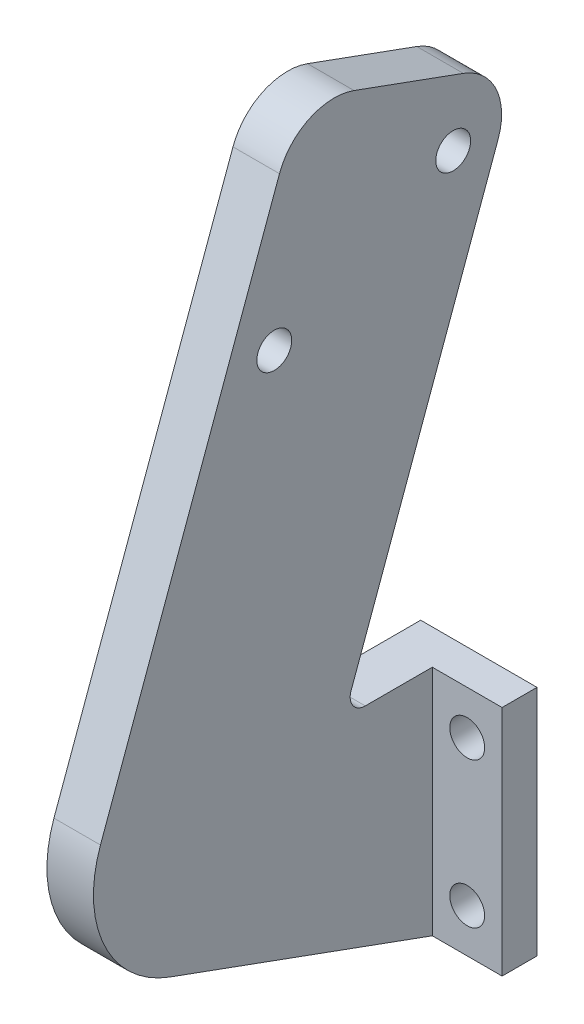
ISO-10303-21;
HEADER;
FILE_DESCRIPTION(('STEP AP214'),'2;1');
FILE_NAME('part.step','',(''),(''),'','','');
FILE_SCHEMA(('AUTOMOTIVE_DESIGN { 1 0 10303 214 1 1 1 1 }'));
ENDSEC;
DATA;
#1=APPLICATION_CONTEXT('core data for automotive mechanical design processes');
#2=APPLICATION_PROTOCOL_DEFINITION('international standard','automotive_design',2000,#1);
#3=PRODUCT_CONTEXT('',#1,'mechanical');
#4=PRODUCT('Part','Part','',(#3));
#5=PRODUCT_RELATED_PRODUCT_CATEGORY('part','',(#4));
#6=PRODUCT_DEFINITION_FORMATION('','',#4);
#7=PRODUCT_DEFINITION_CONTEXT('part definition',#1,'design');
#8=PRODUCT_DEFINITION('design','',#6,#7);
#9=PRODUCT_DEFINITION_SHAPE('','',#8);
#10=(LENGTH_UNIT() NAMED_UNIT(*) SI_UNIT(.MILLI.,.METRE.));
#11=(NAMED_UNIT(*) PLANE_ANGLE_UNIT() SI_UNIT($,.RADIAN.));
#12=(NAMED_UNIT(*) SI_UNIT($,.STERADIAN.) SOLID_ANGLE_UNIT());
#13=UNCERTAINTY_MEASURE_WITH_UNIT(LENGTH_MEASURE(1.E-05),#10,'distance_accuracy_value','');
#14=(GEOMETRIC_REPRESENTATION_CONTEXT(3) GLOBAL_UNCERTAINTY_ASSIGNED_CONTEXT((#13)) GLOBAL_UNIT_ASSIGNED_CONTEXT((#10,
#11,#12)) REPRESENTATION_CONTEXT('',''));
#15=CARTESIAN_POINT('',(0.,0.,0.));
#16=DIRECTION('',(0.,0.,1.));
#17=DIRECTION('',(1.,0.,0.));
#18=AXIS2_PLACEMENT_3D('',#15,#16,#17);
#19=CARTESIAN_POINT('',(0.,0.,0.));
#20=DIRECTION('',(0.,0.,-1.));
#21=DIRECTION('',(-1.,0.,0.));
#22=AXIS2_PLACEMENT_3D('',#19,#20,#21);
#23=PLANE('',#22);
#24=CARTESIAN_POINT('',(14.0000000000001,3.75,0.));
#25=DIRECTION('',(0.,0.,1.));
#26=DIRECTION('',(1.,0.,0.));
#27=AXIS2_PLACEMENT_3D('',#24,#25,#26);
#28=CIRCLE('',#27,1.5);
#29=CARTESIAN_POINT('',(15.5000000000001,3.75,0.));
#30=VERTEX_POINT('',#29);
#31=EDGE_CURVE('E158',#30,#30,#28,.T.);
#32=ORIENTED_EDGE('',*,*,#31,.T.);
#33=EDGE_LOOP('',(#32));
#34=FACE_BOUND('',#33,.T.);
#35=CARTESIAN_POINT('',(14.,16.25,0.));
#36=DIRECTION('',(0.,0.,1.));
#37=DIRECTION('',(1.,0.,0.));
#38=AXIS2_PLACEMENT_3D('',#35,#36,#37);
#39=CIRCLE('',#38,1.5);
#40=CARTESIAN_POINT('',(15.5,16.25,0.));
#41=VERTEX_POINT('',#40);
#42=EDGE_CURVE('E172',#41,#41,#39,.T.);
#43=ORIENTED_EDGE('',*,*,#42,.T.);
#44=EDGE_LOOP('',(#43));
#45=FACE_BOUND('',#44,.T.);
#46=DIRECTION('',(1.,0.,0.));
#47=VECTOR('',#46,1.);
#48=CARTESIAN_POINT('',(0.,0.,0.));
#49=LINE('',#48,#47);
#50=CARTESIAN_POINT('',(7.,0.,0.));
#51=VERTEX_POINT('',#50);
#52=CARTESIAN_POINT('',(17.,0.,0.));
#53=VERTEX_POINT('',#52);
#54=EDGE_CURVE('E178',#51,#53,#49,.T.);
#55=ORIENTED_EDGE('',*,*,#54,.F.);
#56=DIRECTION('',(0.,-1.,0.));
#57=VECTOR('',#56,1.);
#58=CARTESIAN_POINT('',(7.,20.,0.));
#59=LINE('',#58,#57);
#60=CARTESIAN_POINT('',(7.,20.,0.));
#61=VERTEX_POINT('',#60);
#62=EDGE_CURVE('E134',#61,#51,#59,.T.);
#63=ORIENTED_EDGE('',*,*,#62,.F.);
#64=DIRECTION('',(-1.,0.,0.));
#65=VECTOR('',#64,1.);
#66=CARTESIAN_POINT('',(0.,20.,0.));
#67=LINE('',#66,#65);
#68=CARTESIAN_POINT('',(17.,20.,0.));
#69=VERTEX_POINT('',#68);
#70=EDGE_CURVE('E185',#69,#61,#67,.T.);
#71=ORIENTED_EDGE('',*,*,#70,.F.);
#72=DIRECTION('',(0.,1.,0.));
#73=VECTOR('',#72,1.);
#74=CARTESIAN_POINT('',(17.,0.,0.));
#75=LINE('',#74,#73);
#76=EDGE_CURVE('E195',#53,#69,#75,.T.);
#77=ORIENTED_EDGE('',*,*,#76,.F.);
#78=EDGE_LOOP('',(#55,#63,#71,#77));
#79=FACE_BOUND('',#78,.T.);
#80=ADVANCED_FACE('F41',(#34,#45,#79),#23,.T.);
#81=CARTESIAN_POINT('',(0.,0.,3.));
#82=DIRECTION('',(0.,1.,0.));
#83=DIRECTION('',(0.,0.,1.));
#84=AXIS2_PLACEMENT_3D('',#81,#82,#83);
#85=PLANE('',#84);
#86=DIRECTION('',(0.,0.,1.));
#87=VECTOR('',#86,1.);
#88=CARTESIAN_POINT('',(7.,0.,0.));
#89=LINE('',#88,#87);
#90=CARTESIAN_POINT('',(7.,0.,3.));
#91=VERTEX_POINT('',#90);
#92=EDGE_CURVE('E131',#51,#91,#89,.T.);
#93=ORIENTED_EDGE('',*,*,#92,.F.);
#94=ORIENTED_EDGE('',*,*,#54,.T.);
#95=DIRECTION('',(0.,0.,-1.));
#96=VECTOR('',#95,1.);
#97=CARTESIAN_POINT('',(17.,0.,3.));
#98=LINE('',#97,#96);
#99=CARTESIAN_POINT('',(17.,0.,3.));
#100=VERTEX_POINT('',#99);
#101=EDGE_CURVE('E204',#100,#53,#98,.T.);
#102=ORIENTED_EDGE('',*,*,#101,.F.);
#103=DIRECTION('',(1.,0.,0.));
#104=VECTOR('',#103,1.);
#105=CARTESIAN_POINT('',(0.,0.,3.));
#106=LINE('',#105,#104);
#107=CARTESIAN_POINT('',(11.,0.,3.));
#108=VERTEX_POINT('',#107);
#109=EDGE_CURVE('E156',#108,#100,#106,.T.);
#110=ORIENTED_EDGE('',*,*,#109,.F.);
#111=DIRECTION('',(-1.,0.,0.));
#112=VECTOR('',#111,1.);
#113=CARTESIAN_POINT('',(11.,0.,3.));
#114=LINE('',#113,#112);
#115=EDGE_CURVE('E146',#108,#91,#114,.T.);
#116=ORIENTED_EDGE('',*,*,#115,.T.);
#117=EDGE_LOOP('',(#93,#94,#102,#110,#116));
#118=FACE_BOUND('',#117,.T.);
#119=ADVANCED_FACE('F154',(#118),#85,.F.);
#120=CARTESIAN_POINT('',(0.,20.,3.));
#121=DIRECTION('',(0.,-1.,0.));
#122=DIRECTION('',(0.,0.,-1.));
#123=AXIS2_PLACEMENT_3D('',#120,#121,#122);
#124=PLANE('',#123);
#125=DIRECTION('',(0.,0.,-1.));
#126=VECTOR('',#125,1.);
#127=CARTESIAN_POINT('',(7.,20.,8.76249172057397));
#128=LINE('',#127,#126);
#129=CARTESIAN_POINT('',(7.,20.,8.76249172057397));
#130=VERTEX_POINT('',#129);
#131=EDGE_CURVE('E263',#130,#61,#128,.T.);
#132=ORIENTED_EDGE('',*,*,#131,.F.);
#133=DIRECTION('',(-1.,0.,0.));
#134=VECTOR('',#133,1.);
#135=CARTESIAN_POINT('',(0.,20.,8.76249172057397));
#136=LINE('',#135,#134);
#137=CARTESIAN_POINT('',(11.,20.,8.76249172057397));
#138=VERTEX_POINT('',#137);
#139=EDGE_CURVE('E233',#130,#138,#136,.F.);
#140=ORIENTED_EDGE('',*,*,#139,.T.);
#141=DIRECTION('',(0.,0.,-1.));
#142=VECTOR('',#141,1.);
#143=CARTESIAN_POINT('',(11.,20.,3.));
#144=LINE('',#143,#142);
#145=CARTESIAN_POINT('',(11.,20.,3.));
#146=VERTEX_POINT('',#145);
#147=EDGE_CURVE('E159',#138,#146,#144,.T.);
#148=ORIENTED_EDGE('',*,*,#147,.T.);
#149=DIRECTION('',(-1.,0.,0.));
#150=VECTOR('',#149,1.);
#151=CARTESIAN_POINT('',(0.,20.,3.));
#152=LINE('',#151,#150);
#153=CARTESIAN_POINT('',(17.,20.,3.));
#154=VERTEX_POINT('',#153);
#155=EDGE_CURVE('E188',#154,#146,#152,.T.);
#156=ORIENTED_EDGE('',*,*,#155,.F.);
#157=DIRECTION('',(0.,0.,-1.));
#158=VECTOR('',#157,1.);
#159=CARTESIAN_POINT('',(17.,20.,3.));
#160=LINE('',#159,#158);
#161=EDGE_CURVE('E192',#154,#69,#160,.T.);
#162=ORIENTED_EDGE('',*,*,#161,.T.);
#163=ORIENTED_EDGE('',*,*,#70,.T.);
#164=EDGE_LOOP('',(#132,#140,#148,#156,#162,#163));
#165=FACE_BOUND('',#164,.T.);
#166=ADVANCED_FACE('F351',(#165),#124,.F.);
#167=CARTESIAN_POINT('',(11.,20.,10.6190841293387));
#168=DIRECTION('',(0.,-0.34202014332567,-0.939692620785908));
#169=DIRECTION('',(0.,0.939692620785908,-0.34202014332567));
#170=AXIS2_PLACEMENT_3D('',#167,#168,#169);
#171=PLANE('',#170);
#172=DIRECTION('',(-1.,0.,0.));
#173=VECTOR('',#172,1.);
#174=CARTESIAN_POINT('',(11.,21.7446261863234,9.98409212759565));
#175=LINE('',#174,#173);
#176=CARTESIAN_POINT('',(11.,21.7446261863234,9.98409212759565));
#177=VERTEX_POINT('',#176);
#178=CARTESIAN_POINT('',(7.,21.7446261863234,9.98409212759565));
#179=VERTEX_POINT('',#178);
#180=EDGE_CURVE('E229',#177,#179,#175,.T.);
#181=ORIENTED_EDGE('',*,*,#180,.T.);
#182=DIRECTION('',(0.,-0.939692620785908,0.34202014332567));
#183=VECTOR('',#182,1.);
#184=CARTESIAN_POINT('',(7.,56.4713761497843,-2.65541119190911));
#185=LINE('',#184,#183);
#186=CARTESIAN_POINT('',(7.,56.4713761497843,-2.65541119190911));
#187=VERTEX_POINT('',#186);
#188=EDGE_CURVE('E264',#187,#179,#185,.T.);
#189=ORIENTED_EDGE('',*,*,#188,.F.);
#190=DIRECTION('',(-1.,0.,0.));
#191=VECTOR('',#190,1.);
#192=CARTESIAN_POINT('',(11.,56.4713761497843,-2.65541119190911));
#193=LINE('',#192,#191);
#194=CARTESIAN_POINT('',(11.,56.4713761497843,-2.65541119190911));
#195=VERTEX_POINT('',#194);
#196=EDGE_CURVE('E226',#187,#195,#193,.F.);
#197=ORIENTED_EDGE('',*,*,#196,.T.);
#198=DIRECTION('',(0.,-0.939692620785908,0.34202014332567));
#199=VECTOR('',#198,1.);
#200=CARTESIAN_POINT('',(11.,20.,10.6190841293387));
#201=LINE('',#200,#199);
#202=EDGE_CURVE('E166',#195,#177,#201,.T.);
#203=ORIENTED_EDGE('',*,*,#202,.T.);
#204=EDGE_LOOP('',(#181,#189,#197,#203));
#205=FACE_BOUND('',#204,.T.);
#206=ADVANCED_FACE('F253',(#205),#171,.T.);
#207=CARTESIAN_POINT('',(11.,61.1698392537139,-4.36551190853746));
#208=DIRECTION('',(0.,0.939692620785908,-0.34202014332567));
#209=DIRECTION('',(0.,0.34202014332567,0.939692620785908));
#210=AXIS2_PLACEMENT_3D('',#207,#208,#209);
#211=PLANE('',#210);
#212=DIRECTION('',(-1.,0.,0.));
#213=VECTOR('',#212,1.);
#214=CARTESIAN_POINT('',(11.,62.8799399703422,0.332951195392088));
#215=LINE('',#214,#213);
#216=CARTESIAN_POINT('',(11.,62.8799399703422,0.33295119539209));
#217=VERTEX_POINT('',#216);
#218=CARTESIAN_POINT('',(7.,62.8799399703422,0.33295119539209));
#219=VERTEX_POINT('',#218);
#220=EDGE_CURVE('E212',#217,#219,#215,.T.);
#221=ORIENTED_EDGE('',*,*,#220,.T.);
#222=DIRECTION('',(0.,-0.342020143325669,-0.939692620785908));
#223=VECTOR('',#222,1.);
#224=CARTESIAN_POINT('',(7.,66.3001414035989,9.72987740325117));
#225=LINE('',#224,#223);
#226=CARTESIAN_POINT('',(7.,66.3001414035989,9.72987740325117));
#227=VERTEX_POINT('',#226);
#228=EDGE_CURVE('E305',#227,#219,#225,.T.);
#229=ORIENTED_EDGE('',*,*,#228,.F.);
#230=DIRECTION('',(-1.,0.,0.));
#231=VECTOR('',#230,1.);
#232=CARTESIAN_POINT('',(11.,66.3001414035989,9.72987740325117));
#233=LINE('',#232,#231);
#234=CARTESIAN_POINT('',(11.,66.3001414035989,9.72987740325117));
#235=VERTEX_POINT('',#234);
#236=EDGE_CURVE('E216',#227,#235,#233,.F.);
#237=ORIENTED_EDGE('',*,*,#236,.T.);
#238=DIRECTION('',(0.,-0.34202014332567,-0.939692620785908));
#239=VECTOR('',#238,1.);
#240=CARTESIAN_POINT('',(11.,61.1698392537139,-4.36551190853746));
#241=LINE('',#240,#239);
#242=EDGE_CURVE('E257',#235,#217,#241,.T.);
#243=ORIENTED_EDGE('',*,*,#242,.T.);
#244=EDGE_LOOP('',(#221,#229,#237,#243));
#245=FACE_BOUND('',#244,.T.);
#246=ADVANCED_FACE('F297',(#245),#211,.T.);
#247=CARTESIAN_POINT('',(11.,68.0102421202272,14.4283405071807));
#248=DIRECTION('',(0.,0.34202014332567,0.939692620785908));
#249=DIRECTION('',(0.,-0.939692620785908,0.34202014332567));
#250=AXIS2_PLACEMENT_3D('',#247,#248,#249);
#251=PLANE('',#250);
#252=DIRECTION('',(-1.,0.,0.));
#253=VECTOR('',#252,1.);
#254=CARTESIAN_POINT('',(11.,63.3117790162977,16.138441223809));
#255=LINE('',#254,#253);
#256=CARTESIAN_POINT('',(11.,63.3117790162977,16.138441223809));
#257=VERTEX_POINT('',#256);
#258=CARTESIAN_POINT('',(7.,63.3117790162977,16.138441223809));
#259=VERTEX_POINT('',#258);
#260=EDGE_CURVE('E208',#257,#259,#255,.T.);
#261=ORIENTED_EDGE('',*,*,#260,.T.);
#262=DIRECTION('',(0.,0.939692620785908,-0.34202014332567));
#263=VECTOR('',#262,1.);
#264=CARTESIAN_POINT('',(7.,21.0256110809319,31.5293476734642));
#265=LINE('',#264,#263);
#266=CARTESIAN_POINT('',(7.,21.0256110809319,31.5293476734642));
#267=VERTEX_POINT('',#266);
#268=EDGE_CURVE('E312',#267,#259,#265,.T.);
#269=ORIENTED_EDGE('',*,*,#268,.F.);
#270=DIRECTION('',(-1.,0.,0.));
#271=VECTOR('',#270,1.);
#272=CARTESIAN_POINT('',(11.,21.0256110809318,31.5293476734642));
#273=LINE('',#272,#271);
#274=CARTESIAN_POINT('',(11.,21.0256110809319,31.5293476734642));
#275=VERTEX_POINT('',#274);
#276=EDGE_CURVE('E50',#267,#275,#273,.F.);
#277=ORIENTED_EDGE('',*,*,#276,.T.);
#278=DIRECTION('',(0.,0.939692620785908,-0.34202014332567));
#279=VECTOR('',#278,1.);
#280=CARTESIAN_POINT('',(11.,68.0102421202272,14.4283405071807));
#281=LINE('',#280,#279);
#282=EDGE_CURVE('E289',#275,#257,#281,.T.);
#283=ORIENTED_EDGE('',*,*,#282,.T.);
#284=EDGE_LOOP('',(#261,#269,#277,#283));
#285=FACE_BOUND('',#284,.T.);
#286=ADVANCED_FACE('F378',(#285),#251,.T.);
#287=CARTESIAN_POINT('',(11.,11.6286848730728,34.9495491067209));
#288=DIRECTION('',(0.,-0.939692620785908,0.342020143325669));
#289=DIRECTION('',(0.,-0.34202014332567,-0.939692620785908));
#290=AXIS2_PLACEMENT_3D('',#287,#288,#289);
#291=PLANE('',#290);
#292=DIRECTION('',(-1.,0.,0.));
#293=VECTOR('',#292,1.);
#294=CARTESIAN_POINT('',(11.,8.20848343981607,25.5526228988618));
#295=LINE('',#294,#293);
#296=CARTESIAN_POINT('',(11.,8.20848343981607,25.5526228988618));
#297=VERTEX_POINT('',#296);
#298=CARTESIAN_POINT('',(7.,8.20848343981607,25.5526228988618));
#299=VERTEX_POINT('',#298);
#300=EDGE_CURVE('E149',#297,#299,#295,.T.);
#301=ORIENTED_EDGE('',*,*,#300,.T.);
#302=DIRECTION('',(0.,0.342020143325669,0.939692620785908));
#303=VECTOR('',#302,1.);
#304=CARTESIAN_POINT('',(7.,0.,3.));
#305=LINE('',#304,#303);
#306=EDGE_CURVE('E57',#91,#299,#305,.T.);
#307=ORIENTED_EDGE('',*,*,#306,.F.);
#308=ORIENTED_EDGE('',*,*,#115,.F.);
#309=DIRECTION('',(0.,0.34202014332567,0.939692620785908));
#310=VECTOR('',#309,1.);
#311=CARTESIAN_POINT('',(11.,11.6286848730728,34.9495491067209));
#312=LINE('',#311,#310);
#313=EDGE_CURVE('E286',#108,#297,#312,.T.);
#314=ORIENTED_EDGE('',*,*,#313,.T.);
#315=EDGE_LOOP('',(#301,#307,#308,#314));
#316=FACE_BOUND('',#315,.T.);
#317=ADVANCED_FACE('F144',(#316),#291,.T.);
#318=CARTESIAN_POINT('',(6.,57.5575489368512,1.20596533423222));
#319=DIRECTION('',(1.,0.,0.));
#320=DIRECTION('',(0.,0.,-1.));
#321=AXIS2_PLACEMENT_3D('',#318,#319,#320);
#322=CYLINDRICAL_SURFACE('',#321,1.5);
#323=CARTESIAN_POINT('',(11.,57.5575489368512,1.20596533423222));
#324=DIRECTION('',(1.,0.,0.));
#325=DIRECTION('',(0.,0.,-1.));
#326=AXIS2_PLACEMENT_3D('',#323,#324,#325);
#327=CIRCLE('',#326,1.5);
#328=CARTESIAN_POINT('',(11.,57.5575489368512,-0.294034665767778));
#329=VERTEX_POINT('',#328);
#330=EDGE_CURVE('E275',#329,#329,#327,.T.);
#331=ORIENTED_EDGE('',*,*,#330,.T.);
#332=EDGE_LOOP('',(#331));
#333=FACE_BOUND('',#332,.T.);
#334=CARTESIAN_POINT('',(7.,57.5575489368512,1.20596533423222));
#335=DIRECTION('',(-1.,0.,0.));
#336=DIRECTION('',(0.,0.,1.));
#337=AXIS2_PLACEMENT_3D('',#334,#335,#336);
#338=CIRCLE('',#337,1.5);
#339=CARTESIAN_POINT('',(7.,57.5575489368512,2.70596533423223));
#340=VERTEX_POINT('',#339);
#341=EDGE_CURVE('E320',#340,#340,#338,.T.);
#342=ORIENTED_EDGE('',*,*,#341,.T.);
#343=EDGE_LOOP('',(#342));
#344=FACE_BOUND('',#343,.T.);
#345=ADVANCED_FACE('F325',(#333,#344),#322,.F.);
#346=CARTESIAN_POINT('',(6.,50.3854792073284,16.5865185035712));
#347=DIRECTION('',(1.,0.,0.));
#348=DIRECTION('',(0.,0.,-1.));
#349=AXIS2_PLACEMENT_3D('',#346,#347,#348);
#350=CYLINDRICAL_SURFACE('',#349,1.5);
#351=CARTESIAN_POINT('',(11.,50.3854792073284,16.5865185035712));
#352=DIRECTION('',(1.,0.,0.));
#353=DIRECTION('',(0.,0.,-1.));
#354=AXIS2_PLACEMENT_3D('',#351,#352,#353);
#355=CIRCLE('',#354,1.5);
#356=CARTESIAN_POINT('',(11.,50.3854792073284,15.0865185035712));
#357=VERTEX_POINT('',#356);
#358=EDGE_CURVE('E276',#357,#357,#355,.T.);
#359=ORIENTED_EDGE('',*,*,#358,.T.);
#360=EDGE_LOOP('',(#359));
#361=FACE_BOUND('',#360,.T.);
#362=CARTESIAN_POINT('',(7.,50.3854792073284,16.5865185035712));
#363=DIRECTION('',(-1.,0.,0.));
#364=DIRECTION('',(0.,0.,1.));
#365=AXIS2_PLACEMENT_3D('',#362,#363,#364);
#366=CIRCLE('',#365,1.5);
#367=CARTESIAN_POINT('',(7.,50.3854792073284,18.0865185035712));
#368=VERTEX_POINT('',#367);
#369=EDGE_CURVE('E139',#368,#368,#366,.T.);
#370=ORIENTED_EDGE('',*,*,#369,.T.);
#371=EDGE_LOOP('',(#370));
#372=FACE_BOUND('',#371,.T.);
#373=ADVANCED_FACE('F332',(#361,#372),#350,.F.);
#374=CARTESIAN_POINT('',(11.,61.6016782996694,11.4399781198795));
#375=DIRECTION('',(-1.,0.,0.));
#376=DIRECTION('',(0.,0.,1.));
#377=AXIS2_PLACEMENT_3D('',#374,#375,#376);
#378=CYLINDRICAL_SURFACE('',#377,5.);
#379=ORIENTED_EDGE('',*,*,#236,.F.);
#380=CARTESIAN_POINT('',(7.,61.6016782996694,11.4399781198795));
#381=DIRECTION('',(-1.,0.,0.));
#382=DIRECTION('',(0.,0.,1.));
#383=AXIS2_PLACEMENT_3D('',#380,#381,#382);
#384=CIRCLE('',#383,5.);
#385=EDGE_CURVE('E307',#259,#227,#384,.T.);
#386=ORIENTED_EDGE('',*,*,#385,.F.);
#387=ORIENTED_EDGE('',*,*,#260,.F.);
#388=CARTESIAN_POINT('',(11.,61.6016782996694,11.4399781198795));
#389=DIRECTION('',(-1.,0.,0.));
#390=DIRECTION('',(0.,0.,1.));
#391=AXIS2_PLACEMENT_3D('',#388,#389,#390);
#392=CIRCLE('',#391,5.);
#393=EDGE_CURVE('E222',#235,#257,#392,.F.);
#394=ORIENTED_EDGE('',*,*,#393,.F.);
#395=EDGE_LOOP('',(#379,#386,#387,#394));
#396=FACE_BOUND('',#395,.T.);
#397=ADVANCED_FACE('F334',(#396),#378,.T.);
#398=CARTESIAN_POINT('',(11.,58.1814768664127,2.04305191202043));
#399=DIRECTION('',(-1.,0.,0.));
#400=DIRECTION('',(0.,0.,1.));
#401=AXIS2_PLACEMENT_3D('',#398,#399,#400);
#402=CYLINDRICAL_SURFACE('',#401,5.);
#403=ORIENTED_EDGE('',*,*,#196,.F.);
#404=CARTESIAN_POINT('',(7.,58.1814768664127,2.04305191202043));
#405=DIRECTION('',(-1.,0.,0.));
#406=DIRECTION('',(0.,0.,1.));
#407=AXIS2_PLACEMENT_3D('',#404,#405,#406);
#408=CIRCLE('',#407,5.);
#409=EDGE_CURVE('E269',#219,#187,#408,.T.);
#410=ORIENTED_EDGE('',*,*,#409,.F.);
#411=ORIENTED_EDGE('',*,*,#220,.F.);
#412=CARTESIAN_POINT('',(11.,58.1814768664127,2.04305191202043));
#413=DIRECTION('',(-1.,0.,0.));
#414=DIRECTION('',(0.,0.,1.));
#415=AXIS2_PLACEMENT_3D('',#412,#413,#414);
#416=CIRCLE('',#415,5.);
#417=EDGE_CURVE('E219',#195,#217,#416,.F.);
#418=ORIENTED_EDGE('',*,*,#417,.F.);
#419=EDGE_LOOP('',(#403,#410,#411,#418));
#420=FACE_BOUND('',#419,.T.);
#421=ADVANCED_FACE('F303',(#420),#402,.T.);
#422=CARTESIAN_POINT('',(11.,21.3,8.76249172057397));
#423=DIRECTION('',(-1.,0.,0.));
#424=DIRECTION('',(0.,0.,1.));
#425=AXIS2_PLACEMENT_3D('',#422,#423,#424);
#426=CYLINDRICAL_SURFACE('',#425,1.3);
#427=CARTESIAN_POINT('',(7.,21.3,8.76249172057397));
#428=DIRECTION('',(1.,0.,0.));
#429=DIRECTION('',(0.,0.,1.));
#430=AXIS2_PLACEMENT_3D('',#427,#428,#429);
#431=CIRCLE('',#430,1.3);
#432=EDGE_CURVE('E260',#179,#130,#431,.T.);
#433=ORIENTED_EDGE('',*,*,#432,.F.);
#434=ORIENTED_EDGE('',*,*,#180,.F.);
#435=CARTESIAN_POINT('',(11.,21.3,8.76249172057397));
#436=DIRECTION('',(-1.,0.,0.));
#437=DIRECTION('',(0.,0.,1.));
#438=AXIS2_PLACEMENT_3D('',#435,#436,#437);
#439=CIRCLE('',#438,1.3);
#440=EDGE_CURVE('E236',#138,#177,#439,.T.);
#441=ORIENTED_EDGE('',*,*,#440,.F.);
#442=ORIENTED_EDGE('',*,*,#139,.F.);
#443=EDGE_LOOP('',(#433,#434,#441,#442));
#444=FACE_BOUND('',#443,.T.);
#445=ADVANCED_FACE('F259',(#444),#426,.F.);
#446=CARTESIAN_POINT('',(11.,17.6054096476751,22.1324214656051));
#447=DIRECTION('',(-1.,0.,0.));
#448=DIRECTION('',(0.,0.,1.));
#449=AXIS2_PLACEMENT_3D('',#446,#447,#448);
#450=CYLINDRICAL_SURFACE('',#449,10.);
#451=ORIENTED_EDGE('',*,*,#276,.F.);
#452=CARTESIAN_POINT('',(7.,17.6054096476751,22.1324214656051));
#453=DIRECTION('',(-1.,0.,0.));
#454=DIRECTION('',(0.,0.,1.));
#455=AXIS2_PLACEMENT_3D('',#452,#453,#454);
#456=CIRCLE('',#455,10.);
#457=EDGE_CURVE('E151',#299,#267,#456,.T.);
#458=ORIENTED_EDGE('',*,*,#457,.F.);
#459=ORIENTED_EDGE('',*,*,#300,.F.);
#460=CARTESIAN_POINT('',(11.,17.6054096476751,22.1324214656051));
#461=DIRECTION('',(-1.,0.,0.));
#462=DIRECTION('',(0.,0.,1.));
#463=AXIS2_PLACEMENT_3D('',#460,#461,#462);
#464=CIRCLE('',#463,10.);
#465=EDGE_CURVE('E11',#275,#297,#464,.F.);
#466=ORIENTED_EDGE('',*,*,#465,.F.);
#467=EDGE_LOOP('',(#451,#458,#459,#466));
#468=FACE_BOUND('',#467,.T.);
#469=ADVANCED_FACE('F43',(#468),#450,.T.);
#470=CARTESIAN_POINT('',(0.,0.,3.));
#471=DIRECTION('',(0.,0.,-1.));
#472=DIRECTION('',(-1.,0.,0.));
#473=AXIS2_PLACEMENT_3D('',#470,#471,#472);
#474=PLANE('',#473);
#475=CARTESIAN_POINT('',(14.,16.25,3.));
#476=DIRECTION('',(0.,0.,1.));
#477=DIRECTION('',(1.,0.,0.));
#478=AXIS2_PLACEMENT_3D('',#475,#476,#477);
#479=CIRCLE('',#478,1.5);
#480=CARTESIAN_POINT('',(15.5,16.25,3.));
#481=VERTEX_POINT('',#480);
#482=EDGE_CURVE('E174',#481,#481,#479,.T.);
#483=ORIENTED_EDGE('',*,*,#482,.F.);
#484=EDGE_LOOP('',(#483));
#485=FACE_BOUND('',#484,.T.);
#486=CARTESIAN_POINT('',(14.0000000000001,3.75,3.));
#487=DIRECTION('',(0.,0.,1.));
#488=DIRECTION('',(1.,0.,0.));
#489=AXIS2_PLACEMENT_3D('',#486,#487,#488);
#490=CIRCLE('',#489,1.5);
#491=CARTESIAN_POINT('',(15.5000000000001,3.75,3.));
#492=VERTEX_POINT('',#491);
#493=EDGE_CURVE('E164',#492,#492,#490,.T.);
#494=ORIENTED_EDGE('',*,*,#493,.F.);
#495=EDGE_LOOP('',(#494));
#496=FACE_BOUND('',#495,.T.);
#497=DIRECTION('',(0.,-1.,0.));
#498=VECTOR('',#497,1.);
#499=CARTESIAN_POINT('',(11.,20.,3.));
#500=LINE('',#499,#498);
#501=EDGE_CURVE('E280',#146,#108,#500,.T.);
#502=ORIENTED_EDGE('',*,*,#501,.T.);
#503=ORIENTED_EDGE('',*,*,#109,.T.);
#504=DIRECTION('',(0.,1.,0.));
#505=VECTOR('',#504,1.);
#506=CARTESIAN_POINT('',(17.,0.,3.));
#507=LINE('',#506,#505);
#508=EDGE_CURVE('E184',#100,#154,#507,.T.);
#509=ORIENTED_EDGE('',*,*,#508,.T.);
#510=ORIENTED_EDGE('',*,*,#155,.T.);
#511=EDGE_LOOP('',(#502,#503,#509,#510));
#512=FACE_BOUND('',#511,.T.);
#513=ADVANCED_FACE('F356',(#485,#496,#512),#474,.F.);
#514=CARTESIAN_POINT('',(17.,0.,3.));
#515=DIRECTION('',(-1.,0.,0.));
#516=DIRECTION('',(0.,0.,1.));
#517=AXIS2_PLACEMENT_3D('',#514,#515,#516);
#518=PLANE('',#517);
#519=ORIENTED_EDGE('',*,*,#76,.T.);
#520=ORIENTED_EDGE('',*,*,#161,.F.);
#521=ORIENTED_EDGE('',*,*,#508,.F.);
#522=ORIENTED_EDGE('',*,*,#101,.T.);
#523=EDGE_LOOP('',(#519,#520,#521,#522));
#524=FACE_BOUND('',#523,.T.);
#525=ADVANCED_FACE('F361',(#524),#518,.F.);
#526=CARTESIAN_POINT('',(14.,16.25,3.));
#527=DIRECTION('',(0.,0.,-1.));
#528=DIRECTION('',(-1.,0.,0.));
#529=AXIS2_PLACEMENT_3D('',#526,#527,#528);
#530=CYLINDRICAL_SURFACE('',#529,1.5);
#531=ORIENTED_EDGE('',*,*,#482,.T.);
#532=EDGE_LOOP('',(#531));
#533=FACE_BOUND('',#532,.T.);
#534=ORIENTED_EDGE('',*,*,#42,.F.);
#535=EDGE_LOOP('',(#534));
#536=FACE_BOUND('',#535,.T.);
#537=ADVANCED_FACE('F363',(#533,#536),#530,.F.);
#538=CARTESIAN_POINT('',(14.0000000000001,3.75,3.));
#539=DIRECTION('',(0.,0.,-1.));
#540=DIRECTION('',(-1.,0.,0.));
#541=AXIS2_PLACEMENT_3D('',#538,#539,#540);
#542=CYLINDRICAL_SURFACE('',#541,1.5);
#543=ORIENTED_EDGE('',*,*,#493,.T.);
#544=EDGE_LOOP('',(#543));
#545=FACE_BOUND('',#544,.T.);
#546=ORIENTED_EDGE('',*,*,#31,.F.);
#547=EDGE_LOOP('',(#546));
#548=FACE_BOUND('',#547,.T.);
#549=ADVANCED_FACE('F390',(#545,#548),#542,.F.);
#550=CARTESIAN_POINT('',(11.,0.,0.));
#551=DIRECTION('',(-1.,0.,0.));
#552=DIRECTION('',(0.,0.,1.));
#553=AXIS2_PLACEMENT_3D('',#550,#551,#552);
#554=PLANE('',#553);
#555=ORIENTED_EDGE('',*,*,#358,.F.);
#556=EDGE_LOOP('',(#555));
#557=FACE_BOUND('',#556,.T.);
#558=ORIENTED_EDGE('',*,*,#330,.F.);
#559=EDGE_LOOP('',(#558));
#560=FACE_BOUND('',#559,.T.);
#561=ORIENTED_EDGE('',*,*,#282,.F.);
#562=ORIENTED_EDGE('',*,*,#465,.T.);
#563=ORIENTED_EDGE('',*,*,#313,.F.);
#564=ORIENTED_EDGE('',*,*,#501,.F.);
#565=ORIENTED_EDGE('',*,*,#147,.F.);
#566=ORIENTED_EDGE('',*,*,#440,.T.);
#567=ORIENTED_EDGE('',*,*,#202,.F.);
#568=ORIENTED_EDGE('',*,*,#417,.T.);
#569=ORIENTED_EDGE('',*,*,#242,.F.);
#570=ORIENTED_EDGE('',*,*,#393,.T.);
#571=EDGE_LOOP('',(#561,#562,#563,#564,#565,#566,#567,#568,#569,#570));
#572=FACE_BOUND('',#571,.T.);
#573=ADVANCED_FACE('F246',(#557,#560,#572),#554,.F.);
#574=CARTESIAN_POINT('',(7.,17.6054096476751,22.1324214656051));
#575=DIRECTION('',(-1.,0.,0.));
#576=DIRECTION('',(0.,0.,1.));
#577=AXIS2_PLACEMENT_3D('',#574,#575,#576);
#578=PLANE('',#577);
#579=ORIENTED_EDGE('',*,*,#341,.F.);
#580=EDGE_LOOP('',(#579));
#581=FACE_BOUND('',#580,.T.);
#582=ORIENTED_EDGE('',*,*,#369,.F.);
#583=EDGE_LOOP('',(#582));
#584=FACE_BOUND('',#583,.T.);
#585=ORIENTED_EDGE('',*,*,#92,.T.);
#586=ORIENTED_EDGE('',*,*,#306,.T.);
#587=ORIENTED_EDGE('',*,*,#457,.T.);
#588=ORIENTED_EDGE('',*,*,#268,.T.);
#589=ORIENTED_EDGE('',*,*,#385,.T.);
#590=ORIENTED_EDGE('',*,*,#228,.T.);
#591=ORIENTED_EDGE('',*,*,#409,.T.);
#592=ORIENTED_EDGE('',*,*,#188,.T.);
#593=ORIENTED_EDGE('',*,*,#432,.T.);
#594=ORIENTED_EDGE('',*,*,#131,.T.);
#595=ORIENTED_EDGE('',*,*,#62,.T.);
#596=EDGE_LOOP('',(#585,#586,#587,#588,#589,#590,#591,#592,#593,#594,#595));
#597=FACE_BOUND('',#596,.T.);
#598=ADVANCED_FACE('F132',(#581,#584,#597),#578,.T.);
#599=CLOSED_SHELL('',(#80,#119,#166,#206,#246,#286,#317,#345,#373,#397,#421,#445,#469,#513,#525,
#537,#549,#573,#598));
#600=MANIFOLD_SOLID_BREP('B2',#599);
#601=ADVANCED_BREP_SHAPE_REPRESENTATION('',(#18,#600),#14);
#602=SHAPE_DEFINITION_REPRESENTATION(#9,#601);
ENDSEC;
END-ISO-10303-21;
